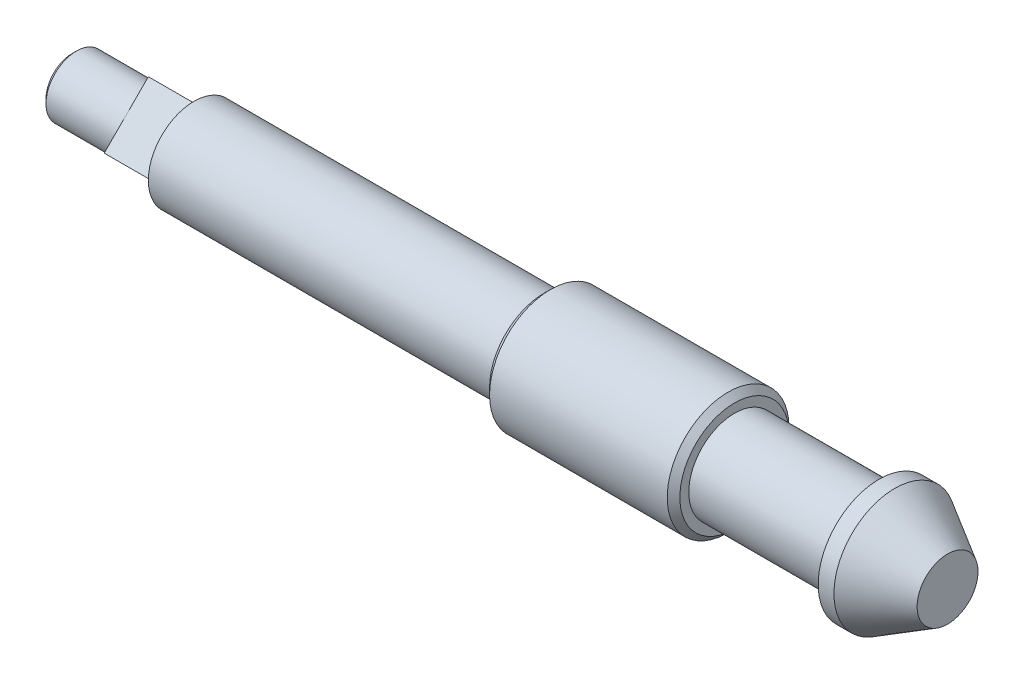
ISO-10303-21;
HEADER;
FILE_DESCRIPTION(('STEP AP214'),'2;1');
FILE_NAME('part.step','',(''),(''),'','','');
FILE_SCHEMA(('AUTOMOTIVE_DESIGN { 1 0 10303 214 1 1 1 1 }'));
ENDSEC;
DATA;
#1=APPLICATION_CONTEXT('core data for automotive mechanical design processes');
#2=APPLICATION_PROTOCOL_DEFINITION('international standard','automotive_design',2000,#1);
#3=PRODUCT_CONTEXT('',#1,'mechanical');
#4=PRODUCT('Part','Part','',(#3));
#5=PRODUCT_RELATED_PRODUCT_CATEGORY('part','',(#4));
#6=PRODUCT_DEFINITION_FORMATION('','',#4);
#7=PRODUCT_DEFINITION_CONTEXT('part definition',#1,'design');
#8=PRODUCT_DEFINITION('design','',#6,#7);
#9=PRODUCT_DEFINITION_SHAPE('','',#8);
#10=(LENGTH_UNIT() NAMED_UNIT(*) SI_UNIT(.MILLI.,.METRE.));
#11=(NAMED_UNIT(*) PLANE_ANGLE_UNIT() SI_UNIT($,.RADIAN.));
#12=(NAMED_UNIT(*) SI_UNIT($,.STERADIAN.) SOLID_ANGLE_UNIT());
#13=UNCERTAINTY_MEASURE_WITH_UNIT(LENGTH_MEASURE(1.E-05),#10,'distance_accuracy_value','');
#14=(GEOMETRIC_REPRESENTATION_CONTEXT(3) GLOBAL_UNCERTAINTY_ASSIGNED_CONTEXT((#13)) GLOBAL_UNIT_ASSIGNED_CONTEXT((#10,
#11,#12)) REPRESENTATION_CONTEXT('',''));
#15=CARTESIAN_POINT('',(0.,0.,0.));
#16=DIRECTION('',(0.,0.,1.));
#17=DIRECTION('',(1.,0.,0.));
#18=AXIS2_PLACEMENT_3D('',#15,#16,#17);
#19=CARTESIAN_POINT('',(0.,0.,0.));
#20=DIRECTION('',(1.,0.,0.));
#21=DIRECTION('',(0.,0.,-1.));
#22=AXIS2_PLACEMENT_3D('',#19,#20,#21);
#23=CYLINDRICAL_SURFACE('',#22,5.99999999999999);
#24=CARTESIAN_POINT('',(-53.,0.,0.));
#25=DIRECTION('',(1.,0.,0.));
#26=DIRECTION('',(0.,0.,-1.));
#27=AXIS2_PLACEMENT_3D('',#24,#25,#26);
#28=CIRCLE('',#27,5.99999999999999);
#29=CARTESIAN_POINT('',(-53.,0.,-5.99999999999999));
#30=VERTEX_POINT('',#29);
#31=EDGE_CURVE('E133',#30,#30,#28,.T.);
#32=ORIENTED_EDGE('',*,*,#31,.F.);
#33=EDGE_LOOP('',(#32));
#34=FACE_BOUND('',#33,.T.);
#35=CARTESIAN_POINT('',(-99.,0.,0.));
#36=DIRECTION('',(-1.,0.,0.));
#37=DIRECTION('',(0.,0.,1.));
#38=AXIS2_PLACEMENT_3D('',#35,#36,#37);
#39=CIRCLE('',#38,5.99999999999998);
#40=CARTESIAN_POINT('',(-99.,0.,5.99999999999998));
#41=VERTEX_POINT('',#40);
#42=EDGE_CURVE('E124',#41,#41,#39,.T.);
#43=ORIENTED_EDGE('',*,*,#42,.F.);
#44=EDGE_LOOP('',(#43));
#45=FACE_BOUND('',#44,.T.);
#46=ADVANCED_FACE('F49',(#34,#45),#23,.T.);
#47=CARTESIAN_POINT('',(0.,0.,0.));
#48=DIRECTION('',(1.,0.,0.));
#49=DIRECTION('',(0.,0.,-1.));
#50=AXIS2_PLACEMENT_3D('',#47,#48,#49);
#51=PLANE('',#50);
#52=CARTESIAN_POINT('',(0.,0.,0.));
#53=DIRECTION('',(1.,0.,0.));
#54=DIRECTION('',(0.,0.,-1.));
#55=AXIS2_PLACEMENT_3D('',#52,#53,#54);
#56=CIRCLE('',#55,4.);
#57=CARTESIAN_POINT('',(0.,0.,-4.));
#58=VERTEX_POINT('',#57);
#59=EDGE_CURVE('E148',#58,#58,#56,.T.);
#60=ORIENTED_EDGE('',*,*,#59,.T.);
#61=EDGE_LOOP('',(#60));
#62=FACE_BOUND('',#61,.T.);
#63=ADVANCED_FACE('F178',(#62),#51,.T.);
#64=CARTESIAN_POINT('',(0.,0.,0.));
#65=DIRECTION('',(-1.,0.,0.));
#66=DIRECTION('',(0.,0.,1.));
#67=AXIS2_PLACEMENT_3D('',#64,#65,#66);
#68=CONICAL_SURFACE('',#67,4.,0.523598775598296);
#69=CARTESIAN_POINT('',(-6.92820323027555,0.,0.));
#70=DIRECTION('',(1.,0.,0.));
#71=DIRECTION('',(0.,0.,-1.));
#72=AXIS2_PLACEMENT_3D('',#69,#70,#71);
#73=CIRCLE('',#72,8.);
#74=CARTESIAN_POINT('',(-6.92820323027555,0.,-8.));
#75=VERTEX_POINT('',#74);
#76=EDGE_CURVE('E145',#75,#75,#73,.T.);
#77=ORIENTED_EDGE('',*,*,#76,.T.);
#78=EDGE_LOOP('',(#77));
#79=FACE_BOUND('',#78,.T.);
#80=ORIENTED_EDGE('',*,*,#59,.F.);
#81=EDGE_LOOP('',(#80));
#82=FACE_BOUND('',#81,.T.);
#83=ADVANCED_FACE('F184',(#79,#82),#68,.T.);
#84=CARTESIAN_POINT('',(0.,0.,0.));
#85=DIRECTION('',(1.,0.,0.));
#86=DIRECTION('',(0.,0.,-1.));
#87=AXIS2_PLACEMENT_3D('',#84,#85,#86);
#88=CYLINDRICAL_SURFACE('',#87,8.);
#89=CARTESIAN_POINT('',(-9.,0.,0.));
#90=DIRECTION('',(1.,0.,0.));
#91=DIRECTION('',(0.,0.,-1.));
#92=AXIS2_PLACEMENT_3D('',#89,#90,#91);
#93=CIRCLE('',#92,8.);
#94=CARTESIAN_POINT('',(-9.,0.,-8.));
#95=VERTEX_POINT('',#94);
#96=EDGE_CURVE('E142',#95,#95,#93,.T.);
#97=ORIENTED_EDGE('',*,*,#96,.T.);
#98=EDGE_LOOP('',(#97));
#99=FACE_BOUND('',#98,.T.);
#100=ORIENTED_EDGE('',*,*,#76,.F.);
#101=EDGE_LOOP('',(#100));
#102=FACE_BOUND('',#101,.T.);
#103=ADVANCED_FACE('F211',(#99,#102),#88,.T.);
#104=CARTESIAN_POINT('',(-9.,8.00000000000018,-1.90819582357449E-13));
#105=DIRECTION('',(-1.,0.,0.));
#106=DIRECTION('',(0.,0.,1.));
#107=AXIS2_PLACEMENT_3D('',#104,#105,#106);
#108=PLANE('',#107);
#109=CARTESIAN_POINT('',(-9.,0.,0.));
#110=DIRECTION('',(1.,0.,0.));
#111=DIRECTION('',(0.,0.,-1.));
#112=AXIS2_PLACEMENT_3D('',#109,#110,#111);
#113=CIRCLE('',#112,6.);
#114=CARTESIAN_POINT('',(-9.,0.,-6.));
#115=VERTEX_POINT('',#114);
#116=EDGE_CURVE('E139',#115,#115,#113,.T.);
#117=ORIENTED_EDGE('',*,*,#116,.T.);
#118=EDGE_LOOP('',(#117));
#119=FACE_BOUND('',#118,.T.);
#120=ORIENTED_EDGE('',*,*,#96,.F.);
#121=EDGE_LOOP('',(#120));
#122=FACE_BOUND('',#121,.T.);
#123=ADVANCED_FACE('F207',(#119,#122),#108,.T.);
#124=CARTESIAN_POINT('',(0.,0.,0.));
#125=DIRECTION('',(1.,0.,0.));
#126=DIRECTION('',(0.,0.,-1.));
#127=AXIS2_PLACEMENT_3D('',#124,#125,#126);
#128=CYLINDRICAL_SURFACE('',#127,6.);
#129=CARTESIAN_POINT('',(-28.,0.,0.));
#130=DIRECTION('',(1.,0.,0.));
#131=DIRECTION('',(0.,0.,-1.));
#132=AXIS2_PLACEMENT_3D('',#129,#130,#131);
#133=CIRCLE('',#132,6.);
#134=CARTESIAN_POINT('',(-28.,0.,-6.));
#135=VERTEX_POINT('',#134);
#136=EDGE_CURVE('E136',#135,#135,#133,.T.);
#137=ORIENTED_EDGE('',*,*,#136,.T.);
#138=EDGE_LOOP('',(#137));
#139=FACE_BOUND('',#138,.T.);
#140=ORIENTED_EDGE('',*,*,#116,.F.);
#141=EDGE_LOOP('',(#140));
#142=FACE_BOUND('',#141,.T.);
#143=ADVANCED_FACE('F203',(#139,#142),#128,.T.);
#144=CARTESIAN_POINT('',(-28.,5.99999999999999,0.));
#145=DIRECTION('',(1.,0.,0.));
#146=DIRECTION('',(0.,0.,-1.));
#147=AXIS2_PLACEMENT_3D('',#144,#145,#146);
#148=PLANE('',#147);
#149=CARTESIAN_POINT('',(-28.,0.,0.));
#150=DIRECTION('',(1.,0.,0.));
#151=DIRECTION('',(0.,0.,-1.));
#152=AXIS2_PLACEMENT_3D('',#149,#150,#151);
#153=CIRCLE('',#152,7.172);
#154=CARTESIAN_POINT('',(-28.,0.,-7.172));
#155=VERTEX_POINT('',#154);
#156=EDGE_CURVE('E160',#155,#155,#153,.T.);
#157=ORIENTED_EDGE('',*,*,#156,.T.);
#158=EDGE_LOOP('',(#157));
#159=FACE_BOUND('',#158,.T.);
#160=ORIENTED_EDGE('',*,*,#136,.F.);
#161=EDGE_LOOP('',(#160));
#162=FACE_BOUND('',#161,.T.);
#163=ADVANCED_FACE('F199',(#159,#162),#148,.T.);
#164=CARTESIAN_POINT('',(0.,0.,0.));
#165=DIRECTION('',(1.,0.,0.));
#166=DIRECTION('',(0.,0.,-1.));
#167=AXIS2_PLACEMENT_3D('',#164,#165,#166);
#168=CYLINDRICAL_SURFACE('',#167,8.);
#169=CARTESIAN_POINT('',(-52.172,0.,0.));
#170=DIRECTION('',(-1.,0.,0.));
#171=DIRECTION('',(0.,0.,1.));
#172=AXIS2_PLACEMENT_3D('',#169,#170,#171);
#173=CIRCLE('',#172,8.);
#174=CARTESIAN_POINT('',(-52.172,0.,8.));
#175=VERTEX_POINT('',#174);
#176=EDGE_CURVE('E154',#175,#175,#173,.F.);
#177=ORIENTED_EDGE('',*,*,#176,.T.);
#178=EDGE_LOOP('',(#177));
#179=FACE_BOUND('',#178,.T.);
#180=CARTESIAN_POINT('',(-28.828,0.,0.));
#181=DIRECTION('',(1.,0.,0.));
#182=DIRECTION('',(0.,0.,-1.));
#183=AXIS2_PLACEMENT_3D('',#180,#181,#182);
#184=CIRCLE('',#183,8.);
#185=CARTESIAN_POINT('',(-28.828,0.,-8.));
#186=VERTEX_POINT('',#185);
#187=EDGE_CURVE('E151',#186,#186,#184,.F.);
#188=ORIENTED_EDGE('',*,*,#187,.T.);
#189=EDGE_LOOP('',(#188));
#190=FACE_BOUND('',#189,.T.);
#191=ADVANCED_FACE('F195',(#179,#190),#168,.T.);
#192=CARTESIAN_POINT('',(-53.,8.00000000000019,-1.97758476261356E-13));
#193=DIRECTION('',(-1.,0.,0.));
#194=DIRECTION('',(0.,0.,1.));
#195=AXIS2_PLACEMENT_3D('',#192,#193,#194);
#196=PLANE('',#195);
#197=CARTESIAN_POINT('',(-53.,0.,0.));
#198=DIRECTION('',(-1.,0.,0.));
#199=DIRECTION('',(0.,0.,1.));
#200=AXIS2_PLACEMENT_3D('',#197,#198,#199);
#201=CIRCLE('',#200,7.17199999999998);
#202=CARTESIAN_POINT('',(-53.,0.,7.17199999999998));
#203=VERTEX_POINT('',#202);
#204=EDGE_CURVE('E157',#203,#203,#201,.T.);
#205=ORIENTED_EDGE('',*,*,#204,.T.);
#206=EDGE_LOOP('',(#205));
#207=FACE_BOUND('',#206,.T.);
#208=ORIENTED_EDGE('',*,*,#31,.T.);
#209=EDGE_LOOP('',(#208));
#210=FACE_BOUND('',#209,.T.);
#211=ADVANCED_FACE('F191',(#207,#210),#196,.T.);
#212=CARTESIAN_POINT('',(-52.172,0.,0.));
#213=DIRECTION('',(1.,0.,0.));
#214=DIRECTION('',(0.,0.,-1.));
#215=AXIS2_PLACEMENT_3D('',#212,#213,#214);
#216=CONICAL_SURFACE('',#215,8.,0.78539816339745);
#217=ORIENTED_EDGE('',*,*,#204,.F.);
#218=EDGE_LOOP('',(#217));
#219=FACE_BOUND('',#218,.T.);
#220=ORIENTED_EDGE('',*,*,#176,.F.);
#221=EDGE_LOOP('',(#220));
#222=FACE_BOUND('',#221,.T.);
#223=ADVANCED_FACE('F194',(#219,#222),#216,.T.);
#224=CARTESIAN_POINT('',(-28.,0.,0.));
#225=DIRECTION('',(-1.,0.,0.));
#226=DIRECTION('',(0.,0.,1.));
#227=AXIS2_PLACEMENT_3D('',#224,#225,#226);
#228=CONICAL_SURFACE('',#227,7.172,0.78539816339745);
#229=ORIENTED_EDGE('',*,*,#187,.F.);
#230=EDGE_LOOP('',(#229));
#231=FACE_BOUND('',#230,.T.);
#232=ORIENTED_EDGE('',*,*,#156,.F.);
#233=EDGE_LOOP('',(#232));
#234=FACE_BOUND('',#233,.T.);
#235=ADVANCED_FACE('F220',(#231,#234),#228,.T.);
#236=CARTESIAN_POINT('',(-99.,0.,0.));
#237=DIRECTION('',(-1.,0.,0.));
#238=DIRECTION('',(0.,0.,1.));
#239=AXIS2_PLACEMENT_3D('',#236,#237,#238);
#240=PLANE('',#239);
#241=DIRECTION('',(0.,0.707106781186547,0.707106781186548));
#242=VECTOR('',#241,1.);
#243=CARTESIAN_POINT('',(-99.,-5.7982756057296,0.));
#244=LINE('',#243,#242);
#245=CARTESIAN_POINT('',(-99.,-5.7982756057296,0.));
#246=VERTEX_POINT('',#245);
#247=CARTESIAN_POINT('',(-99.,0.,5.79827560572969));
#248=VERTEX_POINT('',#247);
#249=EDGE_CURVE('E102',#246,#248,#244,.T.);
#250=ORIENTED_EDGE('',*,*,#249,.F.);
#251=DIRECTION('',(0.,-0.707106781186548,0.707106781186547));
#252=VECTOR('',#251,1.);
#253=CARTESIAN_POINT('',(-99.,0.,-5.79827560572969));
#254=LINE('',#253,#252);
#255=CARTESIAN_POINT('',(-99.,0.,-5.79827560572969));
#256=VERTEX_POINT('',#255);
#257=EDGE_CURVE('E72',#256,#246,#254,.T.);
#258=ORIENTED_EDGE('',*,*,#257,.F.);
#259=DIRECTION('',(0.,-0.707106781186548,-0.707106781186548));
#260=VECTOR('',#259,1.);
#261=CARTESIAN_POINT('',(-99.,5.79827560572969,0.));
#262=LINE('',#261,#260);
#263=CARTESIAN_POINT('',(-99.,5.79827560572969,0.));
#264=VERTEX_POINT('',#263);
#265=EDGE_CURVE('E94',#264,#256,#262,.T.);
#266=ORIENTED_EDGE('',*,*,#265,.F.);
#267=DIRECTION('',(0.,0.707106781186548,-0.707106781186547));
#268=VECTOR('',#267,1.);
#269=CARTESIAN_POINT('',(-99.,0.,5.79827560572969));
#270=LINE('',#269,#268);
#271=EDGE_CURVE('E107',#248,#264,#270,.T.);
#272=ORIENTED_EDGE('',*,*,#271,.F.);
#273=EDGE_LOOP('',(#250,#258,#266,#272));
#274=FACE_BOUND('',#273,.T.);
#275=ORIENTED_EDGE('',*,*,#42,.T.);
#276=EDGE_LOOP('',(#275));
#277=FACE_BOUND('',#276,.T.);
#278=ADVANCED_FACE('F105',(#274,#277),#240,.T.);
#279=CARTESIAN_POINT('',(-99.,0.,5.79827560572969));
#280=DIRECTION('',(0.,0.707106781186547,0.707106781186548));
#281=DIRECTION('',(0.,-0.707106781186548,0.707106781186547));
#282=AXIS2_PLACEMENT_3D('',#279,#280,#281);
#283=PLANE('',#282);
#284=DIRECTION('',(0.,0.707106781186548,-0.707106781186547));
#285=VECTOR('',#284,1.);
#286=CARTESIAN_POINT('',(-105.,0.,5.79827560572969));
#287=LINE('',#286,#285);
#288=CARTESIAN_POINT('',(-105.,0.,5.79827560572969));
#289=VERTEX_POINT('',#288);
#290=CARTESIAN_POINT('',(-105.,5.79827560572969,0.));
#291=VERTEX_POINT('',#290);
#292=EDGE_CURVE('E119',#289,#291,#287,.T.);
#293=ORIENTED_EDGE('',*,*,#292,.F.);
#294=DIRECTION('',(-1.,0.,0.));
#295=VECTOR('',#294,1.);
#296=CARTESIAN_POINT('',(-99.,0.,5.79827560572969));
#297=LINE('',#296,#295);
#298=EDGE_CURVE('E111',#248,#289,#297,.T.);
#299=ORIENTED_EDGE('',*,*,#298,.F.);
#300=ORIENTED_EDGE('',*,*,#271,.T.);
#301=DIRECTION('',(-1.,0.,0.));
#302=VECTOR('',#301,1.);
#303=CARTESIAN_POINT('',(-99.,5.79827560572969,0.));
#304=LINE('',#303,#302);
#305=EDGE_CURVE('E92',#264,#291,#304,.T.);
#306=ORIENTED_EDGE('',*,*,#305,.T.);
#307=EDGE_LOOP('',(#293,#299,#300,#306));
#308=FACE_BOUND('',#307,.T.);
#309=ADVANCED_FACE('F110',(#308),#283,.T.);
#310=CARTESIAN_POINT('',(-99.,-5.7982756057296,0.));
#311=DIRECTION('',(0.,-0.707106781186548,0.707106781186547));
#312=DIRECTION('',(0.,-0.707106781186547,-0.707106781186548));
#313=AXIS2_PLACEMENT_3D('',#310,#311,#312);
#314=PLANE('',#313);
#315=DIRECTION('',(0.,0.707106781186547,0.707106781186548));
#316=VECTOR('',#315,1.);
#317=CARTESIAN_POINT('',(-105.,-5.7982756057296,0.));
#318=LINE('',#317,#316);
#319=CARTESIAN_POINT('',(-105.,-5.7982756057296,0.));
#320=VERTEX_POINT('',#319);
#321=EDGE_CURVE('E112',#320,#289,#318,.T.);
#322=ORIENTED_EDGE('',*,*,#321,.F.);
#323=DIRECTION('',(-1.,0.,0.));
#324=VECTOR('',#323,1.);
#325=CARTESIAN_POINT('',(-99.,-5.7982756057296,0.));
#326=LINE('',#325,#324);
#327=EDGE_CURVE('E125',#246,#320,#326,.T.);
#328=ORIENTED_EDGE('',*,*,#327,.F.);
#329=ORIENTED_EDGE('',*,*,#249,.T.);
#330=ORIENTED_EDGE('',*,*,#298,.T.);
#331=EDGE_LOOP('',(#322,#328,#329,#330));
#332=FACE_BOUND('',#331,.T.);
#333=ADVANCED_FACE('F245',(#332),#314,.T.);
#334=CARTESIAN_POINT('',(-99.,0.,-5.79827560572969));
#335=DIRECTION('',(0.,-0.707106781186547,-0.707106781186548));
#336=DIRECTION('',(0.,0.707106781186548,-0.707106781186547));
#337=AXIS2_PLACEMENT_3D('',#334,#335,#336);
#338=PLANE('',#337);
#339=DIRECTION('',(0.,-0.707106781186548,0.707106781186547));
#340=VECTOR('',#339,1.);
#341=CARTESIAN_POINT('',(-105.,0.,-5.79827560572969));
#342=LINE('',#341,#340);
#343=CARTESIAN_POINT('',(-105.,0.,-5.79827560572969));
#344=VERTEX_POINT('',#343);
#345=EDGE_CURVE('E64',#344,#320,#342,.T.);
#346=ORIENTED_EDGE('',*,*,#345,.F.);
#347=DIRECTION('',(-1.,0.,0.));
#348=VECTOR('',#347,1.);
#349=CARTESIAN_POINT('',(-99.,0.,-5.79827560572969));
#350=LINE('',#349,#348);
#351=EDGE_CURVE('E101',#256,#344,#350,.T.);
#352=ORIENTED_EDGE('',*,*,#351,.F.);
#353=ORIENTED_EDGE('',*,*,#257,.T.);
#354=ORIENTED_EDGE('',*,*,#327,.T.);
#355=EDGE_LOOP('',(#346,#352,#353,#354));
#356=FACE_BOUND('',#355,.T.);
#357=ADVANCED_FACE('F259',(#356),#338,.T.);
#358=CARTESIAN_POINT('',(-99.,5.79827560572969,0.));
#359=DIRECTION('',(0.,0.707106781186547,-0.707106781186548));
#360=DIRECTION('',(0.,0.707106781186548,0.707106781186547));
#361=AXIS2_PLACEMENT_3D('',#358,#359,#360);
#362=PLANE('',#361);
#363=DIRECTION('',(0.,-0.707106781186548,-0.707106781186548));
#364=VECTOR('',#363,1.);
#365=CARTESIAN_POINT('',(-105.,5.79827560572969,0.));
#366=LINE('',#365,#364);
#367=EDGE_CURVE('E96',#291,#344,#366,.T.);
#368=ORIENTED_EDGE('',*,*,#367,.F.);
#369=ORIENTED_EDGE('',*,*,#305,.F.);
#370=ORIENTED_EDGE('',*,*,#265,.T.);
#371=ORIENTED_EDGE('',*,*,#351,.T.);
#372=EDGE_LOOP('',(#368,#369,#370,#371));
#373=FACE_BOUND('',#372,.T.);
#374=ADVANCED_FACE('F93',(#373),#362,.T.);
#375=CARTESIAN_POINT('',(-115.,5.99999999999999,0.));
#376=DIRECTION('',(-1.,0.,0.));
#377=DIRECTION('',(0.,0.,1.));
#378=AXIS2_PLACEMENT_3D('',#375,#376,#377);
#379=PLANE('',#378);
#380=CARTESIAN_POINT('',(-115.,0.,0.));
#381=DIRECTION('',(-1.,0.,0.));
#382=DIRECTION('',(0.,0.,1.));
#383=AXIS2_PLACEMENT_3D('',#380,#381,#382);
#384=CIRCLE('',#383,3.4455);
#385=CARTESIAN_POINT('',(-115.,0.,3.4455));
#386=VERTEX_POINT('',#385);
#387=EDGE_CURVE('E57',#386,#386,#384,.T.);
#388=ORIENTED_EDGE('',*,*,#387,.T.);
#389=EDGE_LOOP('',(#388));
#390=FACE_BOUND('',#389,.T.);
#391=ADVANCED_FACE('F165',(#390),#379,.T.);
#392=CARTESIAN_POINT('',(-105.,0.,0.));
#393=DIRECTION('',(-1.,0.,0.));
#394=DIRECTION('',(0.,0.,1.));
#395=AXIS2_PLACEMENT_3D('',#392,#393,#394);
#396=CYLINDRICAL_SURFACE('',#395,4.);
#397=CARTESIAN_POINT('',(-114.4455,0.,0.));
#398=DIRECTION('',(-1.,0.,0.));
#399=DIRECTION('',(0.,0.,1.));
#400=AXIS2_PLACEMENT_3D('',#397,#398,#399);
#401=CIRCLE('',#400,4.);
#402=CARTESIAN_POINT('',(-114.4455,0.,4.));
#403=VERTEX_POINT('',#402);
#404=EDGE_CURVE('E13',#403,#403,#401,.F.);
#405=ORIENTED_EDGE('',*,*,#404,.T.);
#406=EDGE_LOOP('',(#405));
#407=FACE_BOUND('',#406,.T.);
#408=CARTESIAN_POINT('',(-105.,0.,0.));
#409=DIRECTION('',(-1.,0.,0.));
#410=DIRECTION('',(0.,0.,1.));
#411=AXIS2_PLACEMENT_3D('',#408,#409,#410);
#412=CIRCLE('',#411,4.);
#413=CARTESIAN_POINT('',(-105.,0.,4.));
#414=VERTEX_POINT('',#413);
#415=EDGE_CURVE('E130',#414,#414,#412,.T.);
#416=ORIENTED_EDGE('',*,*,#415,.T.);
#417=EDGE_LOOP('',(#416));
#418=FACE_BOUND('',#417,.T.);
#419=ADVANCED_FACE('F173',(#407,#418),#396,.T.);
#420=CARTESIAN_POINT('',(-105.,0.,0.));
#421=DIRECTION('',(-1.,0.,0.));
#422=DIRECTION('',(0.,0.,1.));
#423=AXIS2_PLACEMENT_3D('',#420,#421,#422);
#424=PLANE('',#423);
#425=ORIENTED_EDGE('',*,*,#415,.F.);
#426=EDGE_LOOP('',(#425));
#427=FACE_BOUND('',#426,.T.);
#428=ORIENTED_EDGE('',*,*,#321,.T.);
#429=ORIENTED_EDGE('',*,*,#292,.T.);
#430=ORIENTED_EDGE('',*,*,#367,.T.);
#431=ORIENTED_EDGE('',*,*,#345,.T.);
#432=EDGE_LOOP('',(#428,#429,#430,#431));
#433=FACE_BOUND('',#432,.T.);
#434=ADVANCED_FACE('F168',(#427,#433),#424,.T.);
#435=CARTESIAN_POINT('',(-115.,0.,0.));
#436=DIRECTION('',(1.,0.,0.));
#437=DIRECTION('',(0.,0.,-1.));
#438=AXIS2_PLACEMENT_3D('',#435,#436,#437);
#439=CONICAL_SURFACE('',#438,3.4455,0.785398163397445);
#440=ORIENTED_EDGE('',*,*,#404,.F.);
#441=EDGE_LOOP('',(#440));
#442=FACE_BOUND('',#441,.T.);
#443=ORIENTED_EDGE('',*,*,#387,.F.);
#444=EDGE_LOOP('',(#443));
#445=FACE_BOUND('',#444,.T.);
#446=ADVANCED_FACE('F51',(#442,#445),#439,.T.);
#447=CLOSED_SHELL('',(#46,#63,#83,#103,#123,#143,#163,#191,#211,#223,#235,#278,#309,#333,#357,
#374,#391,#419,#434,#446));
#448=MANIFOLD_SOLID_BREP('B2',#447);
#449=ADVANCED_BREP_SHAPE_REPRESENTATION('',(#18,#448),#14);
#450=SHAPE_DEFINITION_REPRESENTATION(#9,#449);
ENDSEC;
END-ISO-10303-21;
